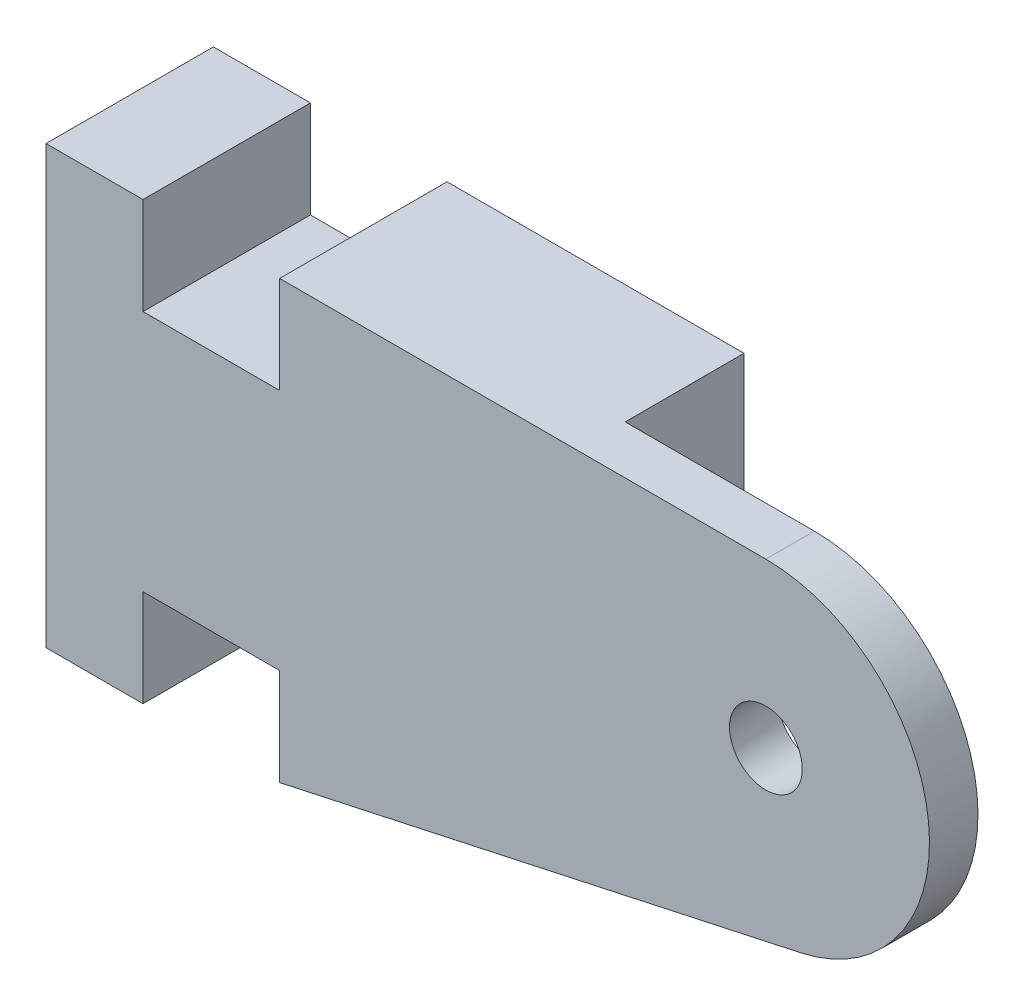
ISO-10303-21;
HEADER;
FILE_DESCRIPTION(('STEP AP214'),'2;1');
FILE_NAME('part.step','',(''),(''),'','','');
FILE_SCHEMA(('AUTOMOTIVE_DESIGN { 1 0 10303 214 1 1 1 1 }'));
ENDSEC;
DATA;
#1=APPLICATION_CONTEXT('core data for automotive mechanical design processes');
#2=APPLICATION_PROTOCOL_DEFINITION('international standard','automotive_design',2000,#1);
#3=PRODUCT_CONTEXT('',#1,'mechanical');
#4=PRODUCT('Part','Part','',(#3));
#5=PRODUCT_RELATED_PRODUCT_CATEGORY('part','',(#4));
#6=PRODUCT_DEFINITION_FORMATION('','',#4);
#7=PRODUCT_DEFINITION_CONTEXT('part definition',#1,'design');
#8=PRODUCT_DEFINITION('design','',#6,#7);
#9=PRODUCT_DEFINITION_SHAPE('','',#8);
#10=(LENGTH_UNIT() NAMED_UNIT(*) SI_UNIT(.MILLI.,.METRE.));
#11=(NAMED_UNIT(*) PLANE_ANGLE_UNIT() SI_UNIT($,.RADIAN.));
#12=(NAMED_UNIT(*) SI_UNIT($,.STERADIAN.) SOLID_ANGLE_UNIT());
#13=UNCERTAINTY_MEASURE_WITH_UNIT(LENGTH_MEASURE(1.E-05),#10,'distance_accuracy_value','');
#14=(GEOMETRIC_REPRESENTATION_CONTEXT(3) GLOBAL_UNCERTAINTY_ASSIGNED_CONTEXT((#13)) GLOBAL_UNIT_ASSIGNED_CONTEXT((#10,
#11,#12)) REPRESENTATION_CONTEXT('',''));
#15=CARTESIAN_POINT('',(0.,0.,0.));
#16=DIRECTION('',(0.,0.,1.));
#17=DIRECTION('',(1.,0.,0.));
#18=AXIS2_PLACEMENT_3D('',#15,#16,#17);
#19=CARTESIAN_POINT('',(29.6765163494173,11.2552969405669,0.));
#20=DIRECTION('',(0.,0.,-1.));
#21=DIRECTION('',(-1.,0.,0.));
#22=AXIS2_PLACEMENT_3D('',#19,#20,#21);
#23=PLANE('',#22);
#24=DIRECTION('',(-1.,0.,0.));
#25=VECTOR('',#24,1.);
#26=CARTESIAN_POINT('',(9.63151634941734,18.0003410835651,0.));
#27=LINE('',#26,#25);
#28=CARTESIAN_POINT('',(21.8764722064192,18.0003410835651,0.));
#29=VERTEX_POINT('',#28);
#30=CARTESIAN_POINT('',(9.63151634941734,18.0003410835651,0.));
#31=VERTEX_POINT('',#30);
#32=EDGE_CURVE('E203',#29,#31,#27,.T.);
#33=ORIENTED_EDGE('',*,*,#32,.F.);
#34=DIRECTION('',(0.,-1.,0.));
#35=VECTOR('',#34,1.);
#36=CARTESIAN_POINT('',(21.8764722064192,2.65915437462125,0.));
#37=LINE('',#36,#35);
#38=CARTESIAN_POINT('',(21.8764722064192,2.65915437462125,0.));
#39=VERTEX_POINT('',#38);
#40=EDGE_CURVE('E177',#29,#39,#37,.T.);
#41=ORIENTED_EDGE('',*,*,#40,.T.);
#42=DIRECTION('',(0.977222602861093,0.21221683358629,0.));
#43=VECTOR('',#42,1.);
#44=CARTESIAN_POINT('',(9.63151634941733,0.,0.));
#45=LINE('',#44,#43);
#46=CARTESIAN_POINT('',(9.63151634941733,0.,0.));
#47=VERTEX_POINT('',#46);
#48=EDGE_CURVE('E208',#47,#39,#45,.T.);
#49=ORIENTED_EDGE('',*,*,#48,.F.);
#50=DIRECTION('',(0.,-1.,0.));
#51=VECTOR('',#50,1.);
#52=CARTESIAN_POINT('',(9.63151634941733,0.,0.));
#53=LINE('',#52,#51);
#54=CARTESIAN_POINT('',(9.63151634941734,4.,0.));
#55=VERTEX_POINT('',#54);
#56=EDGE_CURVE('E248',#55,#47,#53,.T.);
#57=ORIENTED_EDGE('',*,*,#56,.F.);
#58=DIRECTION('',(1.,0.,0.));
#59=VECTOR('',#58,1.);
#60=CARTESIAN_POINT('',(9.63151634941734,4.,0.));
#61=LINE('',#60,#59);
#62=CARTESIAN_POINT('',(4.00000000000001,4.,0.));
#63=VERTEX_POINT('',#62);
#64=EDGE_CURVE('E246',#63,#55,#61,.T.);
#65=ORIENTED_EDGE('',*,*,#64,.F.);
#66=DIRECTION('',(0.,1.,0.));
#67=VECTOR('',#66,1.);
#68=CARTESIAN_POINT('',(4.00000000000001,0.,0.));
#69=LINE('',#68,#67);
#70=CARTESIAN_POINT('',(4.00000000000001,0.,0.));
#71=VERTEX_POINT('',#70);
#72=EDGE_CURVE('E244',#71,#63,#69,.T.);
#73=ORIENTED_EDGE('',*,*,#72,.F.);
#74=DIRECTION('',(1.,0.,0.));
#75=VECTOR('',#74,1.);
#76=CARTESIAN_POINT('',(0.,0.,0.));
#77=LINE('',#76,#75);
#78=CARTESIAN_POINT('',(0.,0.,0.));
#79=VERTEX_POINT('',#78);
#80=EDGE_CURVE('E242',#79,#71,#77,.T.);
#81=ORIENTED_EDGE('',*,*,#80,.F.);
#82=DIRECTION('',(0.,-1.,0.));
#83=VECTOR('',#82,1.);
#84=CARTESIAN_POINT('',(0.,18.0003410835651,0.));
#85=LINE('',#84,#83);
#86=CARTESIAN_POINT('',(0.,18.0003410835651,0.));
#87=VERTEX_POINT('',#86);
#88=EDGE_CURVE('E240',#87,#79,#85,.T.);
#89=ORIENTED_EDGE('',*,*,#88,.F.);
#90=DIRECTION('',(-1.,0.,0.));
#91=VECTOR('',#90,1.);
#92=CARTESIAN_POINT('',(0.,18.0003410835651,0.));
#93=LINE('',#92,#91);
#94=CARTESIAN_POINT('',(4.00000000000001,18.0003410835651,0.));
#95=VERTEX_POINT('',#94);
#96=EDGE_CURVE('E238',#95,#87,#93,.T.);
#97=ORIENTED_EDGE('',*,*,#96,.F.);
#98=DIRECTION('',(0.,1.,0.));
#99=VECTOR('',#98,1.);
#100=CARTESIAN_POINT('',(4.00000000000001,18.0003410835651,0.));
#101=LINE('',#100,#99);
#102=CARTESIAN_POINT('',(4.00000000000001,14.0003410835651,0.));
#103=VERTEX_POINT('',#102);
#104=EDGE_CURVE('E236',#103,#95,#101,.T.);
#105=ORIENTED_EDGE('',*,*,#104,.F.);
#106=DIRECTION('',(-1.,0.,0.));
#107=VECTOR('',#106,1.);
#108=CARTESIAN_POINT('',(9.63151634941734,14.0003410835651,0.));
#109=LINE('',#108,#107);
#110=CARTESIAN_POINT('',(9.63151634941734,14.0003410835651,0.));
#111=VERTEX_POINT('',#110);
#112=EDGE_CURVE('E234',#111,#103,#109,.T.);
#113=ORIENTED_EDGE('',*,*,#112,.F.);
#114=DIRECTION('',(0.,-1.,0.));
#115=VECTOR('',#114,1.);
#116=CARTESIAN_POINT('',(9.63151634941734,18.0003410835651,0.));
#117=LINE('',#116,#115);
#118=EDGE_CURVE('E232',#31,#111,#117,.T.);
#119=ORIENTED_EDGE('',*,*,#118,.F.);
#120=EDGE_LOOP('',(#33,#41,#49,#57,#65,#73,#81,#89,#97,#105,#113,#119));
#121=FACE_BOUND('',#120,.T.);
#122=ADVANCED_FACE('F33',(#121),#23,.T.);
#123=CARTESIAN_POINT('',(9.63151634941734,18.0003410835651,6.9));
#124=DIRECTION('',(0.,-1.,0.));
#125=DIRECTION('',(0.,0.,-1.));
#126=AXIS2_PLACEMENT_3D('',#123,#124,#125);
#127=PLANE('',#126);
#128=DIRECTION('',(0.,0.,-1.));
#129=VECTOR('',#128,1.);
#130=CARTESIAN_POINT('',(21.8764722064192,18.0003410835651,4.9));
#131=LINE('',#130,#129);
#132=CARTESIAN_POINT('',(21.8764722064192,18.0003410835651,4.9));
#133=VERTEX_POINT('',#132);
#134=EDGE_CURVE('E193',#133,#29,#131,.T.);
#135=ORIENTED_EDGE('',*,*,#134,.T.);
#136=ORIENTED_EDGE('',*,*,#32,.T.);
#137=DIRECTION('',(0.,0.,-1.));
#138=VECTOR('',#137,1.);
#139=CARTESIAN_POINT('',(9.63151634941734,18.0003410835651,6.9));
#140=LINE('',#139,#138);
#141=CARTESIAN_POINT('',(9.63151634941734,18.0003410835651,6.9));
#142=VERTEX_POINT('',#141);
#143=EDGE_CURVE('E281',#142,#31,#140,.T.);
#144=ORIENTED_EDGE('',*,*,#143,.F.);
#145=DIRECTION('',(-1.,0.,0.));
#146=VECTOR('',#145,1.);
#147=CARTESIAN_POINT('',(9.63151634941734,18.0003410835651,6.9));
#148=LINE('',#147,#146);
#149=CARTESIAN_POINT('',(29.6765163494173,18.0003410835651,6.9));
#150=VERTEX_POINT('',#149);
#151=EDGE_CURVE('E207',#150,#142,#148,.T.);
#152=ORIENTED_EDGE('',*,*,#151,.F.);
#153=DIRECTION('',(0.,0.,-1.));
#154=VECTOR('',#153,1.);
#155=CARTESIAN_POINT('',(29.6765163494173,18.0003410835651,6.9));
#156=LINE('',#155,#154);
#157=CARTESIAN_POINT('',(29.6765163494173,18.0003410835651,4.9));
#158=VERTEX_POINT('',#157);
#159=EDGE_CURVE('E284',#150,#158,#156,.T.);
#160=ORIENTED_EDGE('',*,*,#159,.T.);
#161=DIRECTION('',(-1.,0.,0.));
#162=VECTOR('',#161,1.);
#163=CARTESIAN_POINT('',(21.8764722064192,18.0003410835651,4.9));
#164=LINE('',#163,#162);
#165=EDGE_CURVE('E180',#158,#133,#164,.T.);
#166=ORIENTED_EDGE('',*,*,#165,.T.);
#167=EDGE_LOOP('',(#135,#136,#144,#152,#160,#166));
#168=FACE_BOUND('',#167,.T.);
#169=ADVANCED_FACE('F310',(#168),#127,.F.);
#170=CARTESIAN_POINT('',(9.63151634941733,0.,6.9));
#171=DIRECTION('',(-0.21221683358629,0.977222602861093,0.));
#172=DIRECTION('',(-0.977222602861093,-0.21221683358629,0.));
#173=AXIS2_PLACEMENT_3D('',#170,#171,#172);
#174=PLANE('',#173);
#175=DIRECTION('',(0.,0.,-1.));
#176=VECTOR('',#175,1.);
#177=CARTESIAN_POINT('',(21.8764722064192,2.65915437462125,4.9));
#178=LINE('',#177,#176);
#179=CARTESIAN_POINT('',(21.8764722064192,2.65915437462125,4.9));
#180=VERTEX_POINT('',#179);
#181=EDGE_CURVE('E189',#180,#39,#178,.T.);
#182=ORIENTED_EDGE('',*,*,#181,.F.);
#183=DIRECTION('',(0.977222602861093,0.21221683358629,0.));
#184=VECTOR('',#183,1.);
#185=CARTESIAN_POINT('',(9.63151634941733,0.,4.9));
#186=LINE('',#185,#184);
#187=CARTESIAN_POINT('',(31.1079282598441,4.66388734673334,4.9));
#188=VERTEX_POINT('',#187);
#189=EDGE_CURVE('E197',#180,#188,#186,.T.);
#190=ORIENTED_EDGE('',*,*,#189,.T.);
#191=DIRECTION('',(0.,0.,-1.));
#192=VECTOR('',#191,1.);
#193=CARTESIAN_POINT('',(31.1079282598441,4.66388734673334,6.9));
#194=LINE('',#193,#192);
#195=CARTESIAN_POINT('',(31.1079282598441,4.66388734673334,6.9));
#196=VERTEX_POINT('',#195);
#197=EDGE_CURVE('E230',#196,#188,#194,.T.);
#198=ORIENTED_EDGE('',*,*,#197,.F.);
#199=DIRECTION('',(0.977222602861093,0.21221683358629,0.));
#200=VECTOR('',#199,1.);
#201=CARTESIAN_POINT('',(9.63151634941733,0.,6.9));
#202=LINE('',#201,#200);
#203=CARTESIAN_POINT('',(9.63151634941733,0.,6.9));
#204=VERTEX_POINT('',#203);
#205=EDGE_CURVE('E228',#204,#196,#202,.T.);
#206=ORIENTED_EDGE('',*,*,#205,.F.);
#207=DIRECTION('',(0.,0.,-1.));
#208=VECTOR('',#207,1.);
#209=CARTESIAN_POINT('',(9.63151634941733,0.,6.9));
#210=LINE('',#209,#208);
#211=EDGE_CURVE('E254',#204,#47,#210,.T.);
#212=ORIENTED_EDGE('',*,*,#211,.T.);
#213=ORIENTED_EDGE('',*,*,#48,.T.);
#214=EDGE_LOOP('',(#182,#190,#198,#206,#212,#213));
#215=FACE_BOUND('',#214,.T.);
#216=ADVANCED_FACE('F316',(#215),#174,.F.);
#217=CARTESIAN_POINT('',(29.6765163494173,11.2552969405669,6.9));
#218=DIRECTION('',(0.,0.,-1.));
#219=DIRECTION('',(-1.,0.,0.));
#220=AXIS2_PLACEMENT_3D('',#217,#218,#219);
#221=PLANE('',#220);
#222=CARTESIAN_POINT('',(29.6765163494173,11.2552969405669,6.9));
#223=DIRECTION('',(0.,0.,1.));
#224=DIRECTION('',(-1.,0.,0.));
#225=AXIS2_PLACEMENT_3D('',#222,#223,#224);
#226=CIRCLE('',#225,6.74504414299813);
#227=EDGE_CURVE('E204',#196,#150,#226,.T.);
#228=ORIENTED_EDGE('',*,*,#227,.T.);
#229=ORIENTED_EDGE('',*,*,#151,.T.);
#230=DIRECTION('',(0.,-1.,0.));
#231=VECTOR('',#230,1.);
#232=CARTESIAN_POINT('',(9.63151634941734,18.0003410835651,6.9));
#233=LINE('',#232,#231);
#234=CARTESIAN_POINT('',(9.63151634941734,14.0003410835651,6.9));
#235=VERTEX_POINT('',#234);
#236=EDGE_CURVE('E210',#142,#235,#233,.T.);
#237=ORIENTED_EDGE('',*,*,#236,.T.);
#238=DIRECTION('',(-1.,0.,0.));
#239=VECTOR('',#238,1.);
#240=CARTESIAN_POINT('',(9.63151634941734,14.0003410835651,6.9));
#241=LINE('',#240,#239);
#242=CARTESIAN_POINT('',(4.00000000000001,14.0003410835651,6.9));
#243=VERTEX_POINT('',#242);
#244=EDGE_CURVE('E212',#235,#243,#241,.T.);
#245=ORIENTED_EDGE('',*,*,#244,.T.);
#246=DIRECTION('',(0.,1.,0.));
#247=VECTOR('',#246,1.);
#248=CARTESIAN_POINT('',(4.00000000000001,18.0003410835651,6.9));
#249=LINE('',#248,#247);
#250=CARTESIAN_POINT('',(4.00000000000001,18.0003410835651,6.9));
#251=VERTEX_POINT('',#250);
#252=EDGE_CURVE('E214',#243,#251,#249,.T.);
#253=ORIENTED_EDGE('',*,*,#252,.T.);
#254=DIRECTION('',(-1.,0.,0.));
#255=VECTOR('',#254,1.);
#256=CARTESIAN_POINT('',(0.,18.0003410835651,6.9));
#257=LINE('',#256,#255);
#258=CARTESIAN_POINT('',(0.,18.0003410835651,6.9));
#259=VERTEX_POINT('',#258);
#260=EDGE_CURVE('E216',#251,#259,#257,.T.);
#261=ORIENTED_EDGE('',*,*,#260,.T.);
#262=DIRECTION('',(0.,-1.,0.));
#263=VECTOR('',#262,1.);
#264=CARTESIAN_POINT('',(0.,18.0003410835651,6.9));
#265=LINE('',#264,#263);
#266=CARTESIAN_POINT('',(0.,0.,6.9));
#267=VERTEX_POINT('',#266);
#268=EDGE_CURVE('E218',#259,#267,#265,.T.);
#269=ORIENTED_EDGE('',*,*,#268,.T.);
#270=DIRECTION('',(1.,0.,0.));
#271=VECTOR('',#270,1.);
#272=CARTESIAN_POINT('',(0.,0.,6.9));
#273=LINE('',#272,#271);
#274=CARTESIAN_POINT('',(4.00000000000001,0.,6.9));
#275=VERTEX_POINT('',#274);
#276=EDGE_CURVE('E220',#267,#275,#273,.T.);
#277=ORIENTED_EDGE('',*,*,#276,.T.);
#278=DIRECTION('',(0.,1.,0.));
#279=VECTOR('',#278,1.);
#280=CARTESIAN_POINT('',(4.00000000000001,0.,6.9));
#281=LINE('',#280,#279);
#282=CARTESIAN_POINT('',(4.00000000000001,4.,6.9));
#283=VERTEX_POINT('',#282);
#284=EDGE_CURVE('E222',#275,#283,#281,.T.);
#285=ORIENTED_EDGE('',*,*,#284,.T.);
#286=DIRECTION('',(1.,0.,0.));
#287=VECTOR('',#286,1.);
#288=CARTESIAN_POINT('',(9.63151634941734,4.,6.9));
#289=LINE('',#288,#287);
#290=CARTESIAN_POINT('',(9.63151634941734,4.,6.9));
#291=VERTEX_POINT('',#290);
#292=EDGE_CURVE('E224',#283,#291,#289,.T.);
#293=ORIENTED_EDGE('',*,*,#292,.T.);
#294=DIRECTION('',(0.,-1.,0.));
#295=VECTOR('',#294,1.);
#296=CARTESIAN_POINT('',(9.63151634941733,0.,6.9));
#297=LINE('',#296,#295);
#298=EDGE_CURVE('E226',#291,#204,#297,.T.);
#299=ORIENTED_EDGE('',*,*,#298,.T.);
#300=ORIENTED_EDGE('',*,*,#205,.T.);
#301=EDGE_LOOP('',(#228,#229,#237,#245,#253,#261,#269,#277,#285,#293,#299,#300));
#302=FACE_BOUND('',#301,.T.);
#303=CARTESIAN_POINT('',(29.6765163494173,11.2552969405669,6.9));
#304=DIRECTION('',(0.,0.,1.));
#305=DIRECTION('',(-1.,0.,0.));
#306=AXIS2_PLACEMENT_3D('',#303,#304,#305);
#307=CIRCLE('',#306,1.49999999999872);
#308=CARTESIAN_POINT('',(28.1765163494186,11.2552969405669,6.9));
#309=VERTEX_POINT('',#308);
#310=EDGE_CURVE('E200',#309,#309,#307,.T.);
#311=ORIENTED_EDGE('',*,*,#310,.F.);
#312=EDGE_LOOP('',(#311));
#313=FACE_BOUND('',#312,.T.);
#314=ADVANCED_FACE('F321',(#302,#313),#221,.F.);
#315=CARTESIAN_POINT('',(29.6765163494173,11.2552969405669,6.9));
#316=DIRECTION('',(0.,0.,-1.));
#317=DIRECTION('',(-1.,0.,0.));
#318=AXIS2_PLACEMENT_3D('',#315,#316,#317);
#319=CYLINDRICAL_SURFACE('',#318,6.74504414299813);
#320=ORIENTED_EDGE('',*,*,#197,.T.);
#321=CARTESIAN_POINT('',(29.6765163494173,11.2552969405669,4.9));
#322=DIRECTION('',(0.,0.,1.));
#323=DIRECTION('',(1.,0.,0.));
#324=AXIS2_PLACEMENT_3D('',#321,#322,#323);
#325=CIRCLE('',#324,6.74504414299814);
#326=EDGE_CURVE('E186',#188,#158,#325,.T.);
#327=ORIENTED_EDGE('',*,*,#326,.T.);
#328=ORIENTED_EDGE('',*,*,#159,.F.);
#329=ORIENTED_EDGE('',*,*,#227,.F.);
#330=EDGE_LOOP('',(#320,#327,#328,#329));
#331=FACE_BOUND('',#330,.T.);
#332=ADVANCED_FACE('F35',(#331),#319,.T.);
#333=CARTESIAN_POINT('',(9.63151634941734,18.0003410835651,6.9));
#334=DIRECTION('',(1.,0.,0.));
#335=DIRECTION('',(0.,0.,-1.));
#336=AXIS2_PLACEMENT_3D('',#333,#334,#335);
#337=PLANE('',#336);
#338=ORIENTED_EDGE('',*,*,#118,.T.);
#339=DIRECTION('',(0.,0.,-1.));
#340=VECTOR('',#339,1.);
#341=CARTESIAN_POINT('',(9.63151634941734,14.0003410835651,6.9));
#342=LINE('',#341,#340);
#343=EDGE_CURVE('E278',#235,#111,#342,.T.);
#344=ORIENTED_EDGE('',*,*,#343,.F.);
#345=ORIENTED_EDGE('',*,*,#236,.F.);
#346=ORIENTED_EDGE('',*,*,#143,.T.);
#347=EDGE_LOOP('',(#338,#344,#345,#346));
#348=FACE_BOUND('',#347,.T.);
#349=ADVANCED_FACE('F358',(#348),#337,.F.);
#350=CARTESIAN_POINT('',(9.63151634941734,14.0003410835651,6.9));
#351=DIRECTION('',(0.,-1.,0.));
#352=DIRECTION('',(0.,0.,-1.));
#353=AXIS2_PLACEMENT_3D('',#350,#351,#352);
#354=PLANE('',#353);
#355=ORIENTED_EDGE('',*,*,#112,.T.);
#356=DIRECTION('',(0.,0.,-1.));
#357=VECTOR('',#356,1.);
#358=CARTESIAN_POINT('',(4.00000000000001,14.0003410835651,6.9));
#359=LINE('',#358,#357);
#360=EDGE_CURVE('E275',#243,#103,#359,.T.);
#361=ORIENTED_EDGE('',*,*,#360,.F.);
#362=ORIENTED_EDGE('',*,*,#244,.F.);
#363=ORIENTED_EDGE('',*,*,#343,.T.);
#364=EDGE_LOOP('',(#355,#361,#362,#363));
#365=FACE_BOUND('',#364,.T.);
#366=ADVANCED_FACE('F354',(#365),#354,.F.);
#367=CARTESIAN_POINT('',(4.00000000000001,18.0003410835651,6.9));
#368=DIRECTION('',(-1.,0.,0.));
#369=DIRECTION('',(0.,0.,1.));
#370=AXIS2_PLACEMENT_3D('',#367,#368,#369);
#371=PLANE('',#370);
#372=ORIENTED_EDGE('',*,*,#104,.T.);
#373=DIRECTION('',(0.,0.,-1.));
#374=VECTOR('',#373,1.);
#375=CARTESIAN_POINT('',(4.00000000000001,18.0003410835651,6.9));
#376=LINE('',#375,#374);
#377=EDGE_CURVE('E272',#251,#95,#376,.T.);
#378=ORIENTED_EDGE('',*,*,#377,.F.);
#379=ORIENTED_EDGE('',*,*,#252,.F.);
#380=ORIENTED_EDGE('',*,*,#360,.T.);
#381=EDGE_LOOP('',(#372,#378,#379,#380));
#382=FACE_BOUND('',#381,.T.);
#383=ADVANCED_FACE('F350',(#382),#371,.F.);
#384=CARTESIAN_POINT('',(0.,18.0003410835651,6.9));
#385=DIRECTION('',(0.,-1.,0.));
#386=DIRECTION('',(0.,0.,-1.));
#387=AXIS2_PLACEMENT_3D('',#384,#385,#386);
#388=PLANE('',#387);
#389=ORIENTED_EDGE('',*,*,#96,.T.);
#390=DIRECTION('',(0.,0.,-1.));
#391=VECTOR('',#390,1.);
#392=CARTESIAN_POINT('',(0.,18.0003410835651,6.9));
#393=LINE('',#392,#391);
#394=EDGE_CURVE('E269',#259,#87,#393,.T.);
#395=ORIENTED_EDGE('',*,*,#394,.F.);
#396=ORIENTED_EDGE('',*,*,#260,.F.);
#397=ORIENTED_EDGE('',*,*,#377,.T.);
#398=EDGE_LOOP('',(#389,#395,#396,#397));
#399=FACE_BOUND('',#398,.T.);
#400=ADVANCED_FACE('F346',(#399),#388,.F.);
#401=CARTESIAN_POINT('',(0.,18.0003410835651,6.9));
#402=DIRECTION('',(1.,0.,0.));
#403=DIRECTION('',(0.,1.,0.));
#404=AXIS2_PLACEMENT_3D('',#401,#402,#403);
#405=PLANE('',#404);
#406=CARTESIAN_POINT('',(0.,8.,2.45));
#407=DIRECTION('',(-1.,0.,0.));
#408=DIRECTION('',(0.,1.,0.));
#409=AXIS2_PLACEMENT_3D('',#406,#407,#408);
#410=CIRCLE('',#409,1.);
#411=CARTESIAN_POINT('',(0.,9.,2.45));
#412=VERTEX_POINT('',#411);
#413=EDGE_CURVE('E173',#412,#412,#410,.T.);
#414=ORIENTED_EDGE('',*,*,#413,.F.);
#415=EDGE_LOOP('',(#414));
#416=FACE_BOUND('',#415,.T.);
#417=ORIENTED_EDGE('',*,*,#88,.T.);
#418=DIRECTION('',(0.,0.,-1.));
#419=VECTOR('',#418,1.);
#420=CARTESIAN_POINT('',(0.,0.,6.9));
#421=LINE('',#420,#419);
#422=EDGE_CURVE('E266',#267,#79,#421,.T.);
#423=ORIENTED_EDGE('',*,*,#422,.F.);
#424=ORIENTED_EDGE('',*,*,#268,.F.);
#425=ORIENTED_EDGE('',*,*,#394,.T.);
#426=EDGE_LOOP('',(#417,#423,#424,#425));
#427=FACE_BOUND('',#426,.T.);
#428=ADVANCED_FACE('F342',(#416,#427),#405,.F.);
#429=CARTESIAN_POINT('',(0.,0.,6.9));
#430=DIRECTION('',(0.,1.,0.));
#431=DIRECTION('',(0.,0.,1.));
#432=AXIS2_PLACEMENT_3D('',#429,#430,#431);
#433=PLANE('',#432);
#434=ORIENTED_EDGE('',*,*,#80,.T.);
#435=DIRECTION('',(0.,0.,-1.));
#436=VECTOR('',#435,1.);
#437=CARTESIAN_POINT('',(4.00000000000001,0.,6.9));
#438=LINE('',#437,#436);
#439=EDGE_CURVE('E263',#275,#71,#438,.T.);
#440=ORIENTED_EDGE('',*,*,#439,.F.);
#441=ORIENTED_EDGE('',*,*,#276,.F.);
#442=ORIENTED_EDGE('',*,*,#422,.T.);
#443=EDGE_LOOP('',(#434,#440,#441,#442));
#444=FACE_BOUND('',#443,.T.);
#445=ADVANCED_FACE('F338',(#444),#433,.F.);
#446=CARTESIAN_POINT('',(4.00000000000001,0.,6.9));
#447=DIRECTION('',(-1.,0.,0.));
#448=DIRECTION('',(0.,-1.,0.));
#449=AXIS2_PLACEMENT_3D('',#446,#447,#448);
#450=PLANE('',#449);
#451=ORIENTED_EDGE('',*,*,#72,.T.);
#452=DIRECTION('',(0.,0.,-1.));
#453=VECTOR('',#452,1.);
#454=CARTESIAN_POINT('',(4.00000000000001,4.,6.9));
#455=LINE('',#454,#453);
#456=EDGE_CURVE('E260',#283,#63,#455,.T.);
#457=ORIENTED_EDGE('',*,*,#456,.F.);
#458=ORIENTED_EDGE('',*,*,#284,.F.);
#459=ORIENTED_EDGE('',*,*,#439,.T.);
#460=EDGE_LOOP('',(#451,#457,#458,#459));
#461=FACE_BOUND('',#460,.T.);
#462=ADVANCED_FACE('F334',(#461),#450,.F.);
#463=CARTESIAN_POINT('',(9.63151634941734,4.,6.9));
#464=DIRECTION('',(0.,1.,0.));
#465=DIRECTION('',(0.,0.,1.));
#466=AXIS2_PLACEMENT_3D('',#463,#464,#465);
#467=PLANE('',#466);
#468=ORIENTED_EDGE('',*,*,#64,.T.);
#469=DIRECTION('',(0.,0.,-1.));
#470=VECTOR('',#469,1.);
#471=CARTESIAN_POINT('',(9.63151634941734,4.,6.9));
#472=LINE('',#471,#470);
#473=EDGE_CURVE('E257',#291,#55,#472,.T.);
#474=ORIENTED_EDGE('',*,*,#473,.F.);
#475=ORIENTED_EDGE('',*,*,#292,.F.);
#476=ORIENTED_EDGE('',*,*,#456,.T.);
#477=EDGE_LOOP('',(#468,#474,#475,#476));
#478=FACE_BOUND('',#477,.T.);
#479=ADVANCED_FACE('F330',(#478),#467,.F.);
#480=CARTESIAN_POINT('',(9.63151634941733,0.,6.9));
#481=DIRECTION('',(1.,0.,0.));
#482=DIRECTION('',(0.,1.,0.));
#483=AXIS2_PLACEMENT_3D('',#480,#481,#482);
#484=PLANE('',#483);
#485=ORIENTED_EDGE('',*,*,#56,.T.);
#486=ORIENTED_EDGE('',*,*,#211,.F.);
#487=ORIENTED_EDGE('',*,*,#298,.F.);
#488=ORIENTED_EDGE('',*,*,#473,.T.);
#489=EDGE_LOOP('',(#485,#486,#487,#488));
#490=FACE_BOUND('',#489,.T.);
#491=ADVANCED_FACE('F326',(#490),#484,.F.);
#492=CARTESIAN_POINT('',(29.6765163494173,11.2552969405669,6.9));
#493=DIRECTION('',(0.,0.,-1.));
#494=DIRECTION('',(-1.,0.,0.));
#495=AXIS2_PLACEMENT_3D('',#492,#493,#494);
#496=CYLINDRICAL_SURFACE('',#495,1.49999999999872);
#497=CARTESIAN_POINT('',(29.6765163494173,11.2552969405669,4.9));
#498=DIRECTION('',(0.,0.,1.));
#499=DIRECTION('',(1.,0.,0.));
#500=AXIS2_PLACEMENT_3D('',#497,#498,#499);
#501=CIRCLE('',#500,1.49999999999872);
#502=CARTESIAN_POINT('',(31.176516349416,11.2552969405669,4.9));
#503=VERTEX_POINT('',#502);
#504=EDGE_CURVE('E196',#503,#503,#501,.T.);
#505=ORIENTED_EDGE('',*,*,#504,.F.);
#506=EDGE_LOOP('',(#505));
#507=FACE_BOUND('',#506,.T.);
#508=ORIENTED_EDGE('',*,*,#310,.T.);
#509=EDGE_LOOP('',(#508));
#510=FACE_BOUND('',#509,.T.);
#511=ADVANCED_FACE('F329',(#507,#510),#496,.F.);
#512=CARTESIAN_POINT('',(29.6765163494173,11.2552969405669,4.9));
#513=DIRECTION('',(0.,0.,1.));
#514=DIRECTION('',(1.,0.,0.));
#515=AXIS2_PLACEMENT_3D('',#512,#513,#514);
#516=PLANE('',#515);
#517=ORIENTED_EDGE('',*,*,#504,.T.);
#518=EDGE_LOOP('',(#517));
#519=FACE_BOUND('',#518,.T.);
#520=DIRECTION('',(0.,-1.,0.));
#521=VECTOR('',#520,1.);
#522=CARTESIAN_POINT('',(21.8764722064192,2.65915437462125,4.9));
#523=LINE('',#522,#521);
#524=EDGE_CURVE('E183',#133,#180,#523,.T.);
#525=ORIENTED_EDGE('',*,*,#524,.F.);
#526=ORIENTED_EDGE('',*,*,#165,.F.);
#527=ORIENTED_EDGE('',*,*,#326,.F.);
#528=ORIENTED_EDGE('',*,*,#189,.F.);
#529=EDGE_LOOP('',(#525,#526,#527,#528));
#530=FACE_BOUND('',#529,.T.);
#531=ADVANCED_FACE('F406',(#519,#530),#516,.F.);
#532=CARTESIAN_POINT('',(21.8764722064192,2.65915437462125,4.9));
#533=DIRECTION('',(1.,0.,0.));
#534=DIRECTION('',(0.,0.,-1.));
#535=AXIS2_PLACEMENT_3D('',#532,#533,#534);
#536=PLANE('',#535);
#537=CARTESIAN_POINT('',(21.8764722064192,5.733310159641,2.44999999999998));
#538=DIRECTION('',(1.,0.,0.));
#539=DIRECTION('',(0.,-1.,0.));
#540=AXIS2_PLACEMENT_3D('',#537,#538,#539);
#541=ELLIPSE('',#540,1.03527618041008,0.999999999999998);
#542=CARTESIAN_POINT('',(21.8764722064192,4.69803397923092,2.44999999999998));
#543=VERTEX_POINT('',#542);
#544=EDGE_CURVE('E170',#543,#543,#541,.T.);
#545=ORIENTED_EDGE('',*,*,#544,.F.);
#546=EDGE_LOOP('',(#545));
#547=FACE_BOUND('',#546,.T.);
#548=ORIENTED_EDGE('',*,*,#40,.F.);
#549=ORIENTED_EDGE('',*,*,#134,.F.);
#550=ORIENTED_EDGE('',*,*,#524,.T.);
#551=ORIENTED_EDGE('',*,*,#181,.T.);
#552=EDGE_LOOP('',(#548,#549,#550,#551));
#553=FACE_BOUND('',#552,.T.);
#554=ADVANCED_FACE('F305',(#547,#553),#536,.T.);
#555=CARTESIAN_POINT('',(14.,8.00000000000001,2.45));
#556=DIRECTION('',(-1.,0.,0.));
#557=DIRECTION('',(0.,-1.,0.));
#558=AXIS2_PLACEMENT_3D('',#555,#556,#557);
#559=CYLINDRICAL_SURFACE('',#558,1.);
#560=CARTESIAN_POINT('',(13.4170705571992,8.00000000000001,2.44999999999999));
#561=DIRECTION('',(-0.130526192220051,-0.99144486137381,0.));
#562=DIRECTION('',(-0.99144486137381,0.130526192220052,0.));
#563=AXIS2_PLACEMENT_3D('',#560,#561,#562);
#564=ELLIPSE('',#563,7.66129757554036,1.);
#565=CARTESIAN_POINT('',(5.97053764993361,8.98035465560825,2.64724286863466));
#566=VERTEX_POINT('',#565);
#567=CARTESIAN_POINT('',(13.4170705571992,8.00000000000001,3.44999999999999));
#568=VERTEX_POINT('',#567);
#569=EDGE_CURVE('E157',#566,#568,#564,.F.);
#570=ORIENTED_EDGE('',*,*,#569,.T.);
#571=CARTESIAN_POINT('',(13.4170705571992,8.00000000000001,2.44999999999999));
#572=DIRECTION('',(-0.99144486137381,0.130526192220052,0.));
#573=DIRECTION('',(-0.130526192220051,-0.99144486137381,0.));
#574=AXIS2_PLACEMENT_3D('',#571,#572,#573);
#575=ELLIPSE('',#574,1.00862896058015,1.);
#576=CARTESIAN_POINT('',(13.4170705571992,8.00000000000001,1.44999999999999));
#577=VERTEX_POINT('',#576);
#578=EDGE_CURVE('E48',#568,#577,#575,.F.);
#579=ORIENTED_EDGE('',*,*,#578,.T.);
#580=CARTESIAN_POINT('',(5.97053764993361,8.98035465560825,2.25275713136533));
#581=VERTEX_POINT('',#580);
#582=EDGE_CURVE('E156',#577,#581,#564,.F.);
#583=ORIENTED_EDGE('',*,*,#582,.T.);
#584=CARTESIAN_POINT('',(5.70785241166729,8.,2.45));
#585=DIRECTION('',(0.965925826289068,-0.258819045102521,0.));
#586=DIRECTION('',(-0.258819045102521,-0.965925826289068,0.));
#587=AXIS2_PLACEMENT_3D('',#584,#585,#586);
#588=ELLIPSE('',#587,1.03527618041008,1.);
#589=EDGE_CURVE('E11',#566,#581,#588,.F.);
#590=ORIENTED_EDGE('',*,*,#589,.F.);
#591=EDGE_LOOP('',(#570,#579,#583,#590));
#592=FACE_BOUND('',#591,.T.);
#593=ORIENTED_EDGE('',*,*,#413,.T.);
#594=EDGE_LOOP('',(#593));
#595=FACE_BOUND('',#594,.T.);
#596=ADVANCED_FACE('F160',(#592,#595),#559,.F.);
#597=CARTESIAN_POINT('',(6.22427210575995,9.92730453638298,2.44999999999998));
#598=DIRECTION('',(0.965925826289068,-0.258819045102521,0.));
#599=DIRECTION('',(0.258819045102521,0.965925826289068,0.));
#600=AXIS2_PLACEMENT_3D('',#597,#598,#599);
#601=CYLINDRICAL_SURFACE('',#600,0.999999999999998);
#602=ORIENTED_EDGE('',*,*,#544,.T.);
#603=EDGE_LOOP('',(#602));
#604=FACE_BOUND('',#603,.T.);
#605=CARTESIAN_POINT('',(13.4170705571992,8.00000000000001,2.44999999999999));
#606=DIRECTION('',(-0.130526192220051,-0.99144486137381,0.));
#607=DIRECTION('',(-0.99144486137381,0.130526192220052,0.));
#608=AXIS2_PLACEMENT_3D('',#605,#606,#607);
#609=ELLIPSE('',#608,7.66129757554036,1.);
#610=CARTESIAN_POINT('',(14.,7.92325588293782,3.44705082142104));
#611=VERTEX_POINT('',#610);
#612=EDGE_CURVE('E158',#611,#568,#609,.T.);
#613=ORIENTED_EDGE('',*,*,#612,.F.);
#614=CARTESIAN_POINT('',(14.,7.8438045265572,2.44999999999998));
#615=DIRECTION('',(1.,0.,0.));
#616=DIRECTION('',(0.,-1.,0.));
#617=AXIS2_PLACEMENT_3D('',#614,#615,#616);
#618=ELLIPSE('',#617,1.03527618041008,0.999999999999998);
#619=CARTESIAN_POINT('',(14.,7.92325588293808,1.45294917857895));
#620=VERTEX_POINT('',#619);
#621=EDGE_CURVE('E41',#620,#611,#618,.T.);
#622=ORIENTED_EDGE('',*,*,#621,.F.);
#623=EDGE_CURVE('E165',#577,#620,#609,.T.);
#624=ORIENTED_EDGE('',*,*,#623,.F.);
#625=ORIENTED_EDGE('',*,*,#578,.F.);
#626=EDGE_LOOP('',(#613,#622,#624,#625));
#627=FACE_BOUND('',#626,.T.);
#628=ADVANCED_FACE('F296',(#604,#627),#601,.F.);
#629=CARTESIAN_POINT('',(6.22427210575995,9.92730453638298,2.44999999999998));
#630=DIRECTION('',(0.965925826289068,-0.258819045102521,0.));
#631=DIRECTION('',(0.258819045102521,0.965925826289068,0.));
#632=AXIS2_PLACEMENT_3D('',#629,#630,#631);
#633=PLANE('',#632);
#634=ORIENTED_EDGE('',*,*,#589,.T.);
#635=CARTESIAN_POINT('',(6.22427210575995,9.92730453638298,2.44999999999998));
#636=DIRECTION('',(0.965925826289068,-0.258819045102521,0.));
#637=DIRECTION('',(0.258819045102521,0.965925826289068,0.));
#638=AXIS2_PLACEMENT_3D('',#635,#636,#637);
#639=CIRCLE('',#638,0.999999999999998);
#640=EDGE_CURVE('E54',#581,#566,#639,.T.);
#641=ORIENTED_EDGE('',*,*,#640,.T.);
#642=EDGE_LOOP('',(#634,#641));
#643=FACE_BOUND('',#642,.T.);
#644=ADVANCED_FACE('F150',(#643),#633,.T.);
#645=ORIENTED_EDGE('',*,*,#569,.F.);
#646=ORIENTED_EDGE('',*,*,#640,.F.);
#647=ORIENTED_EDGE('',*,*,#582,.F.);
#648=CARTESIAN_POINT('',(13.4170705571992,8.00000000000001,2.44999999999999));
#649=DIRECTION('',(-0.99144486137381,0.130526192220052,0.));
#650=DIRECTION('',(-0.130526192220051,-0.99144486137381,0.));
#651=AXIS2_PLACEMENT_3D('',#648,#649,#650);
#652=ELLIPSE('',#651,1.00862896058015,1.);
#653=EDGE_CURVE('E163',#568,#577,#652,.T.);
#654=ORIENTED_EDGE('',*,*,#653,.F.);
#655=EDGE_LOOP('',(#645,#646,#647,#654));
#656=FACE_BOUND('',#655,.T.);
#657=ADVANCED_FACE('F155',(#656),#601,.F.);
#658=CARTESIAN_POINT('',(14.,8.00000000000001,2.45));
#659=DIRECTION('',(1.,0.,0.));
#660=DIRECTION('',(0.,1.,0.));
#661=AXIS2_PLACEMENT_3D('',#658,#659,#660);
#662=PLANE('',#661);
#663=CARTESIAN_POINT('',(14.,8.00000000000001,2.45));
#664=DIRECTION('',(-1.,0.,0.));
#665=DIRECTION('',(0.,1.,0.));
#666=AXIS2_PLACEMENT_3D('',#663,#664,#665);
#667=CIRCLE('',#666,1.);
#668=EDGE_CURVE('E174',#611,#620,#667,.T.);
#669=ORIENTED_EDGE('',*,*,#668,.T.);
#670=ORIENTED_EDGE('',*,*,#621,.T.);
#671=EDGE_LOOP('',(#669,#670));
#672=FACE_BOUND('',#671,.T.);
#673=ADVANCED_FACE('F291',(#672),#662,.F.);
#674=ORIENTED_EDGE('',*,*,#653,.T.);
#675=ORIENTED_EDGE('',*,*,#623,.T.);
#676=ORIENTED_EDGE('',*,*,#668,.F.);
#677=ORIENTED_EDGE('',*,*,#612,.T.);
#678=EDGE_LOOP('',(#674,#675,#676,#677));
#679=FACE_BOUND('',#678,.T.);
#680=ADVANCED_FACE('F295',(#679),#559,.F.);
#681=CLOSED_SHELL('',(#122,#169,#216,#314,#332,#349,#366,#383,#400,#428,#445,#462,#479,#491,
#511,#531,#554,#596,#628,#644,#657,#673,#680));
#682=MANIFOLD_SOLID_BREP('B2',#681);
#683=ADVANCED_BREP_SHAPE_REPRESENTATION('',(#18,#682),#14);
#684=SHAPE_DEFINITION_REPRESENTATION(#9,#683);
ENDSEC;
END-ISO-10303-21;
